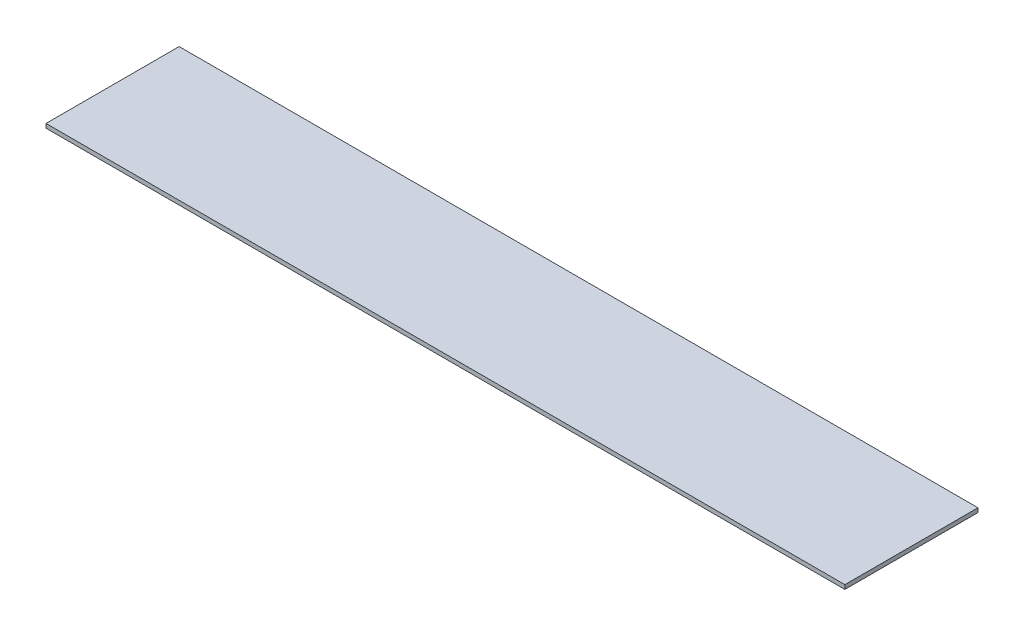
ISO-10303-21;
HEADER;
FILE_DESCRIPTION(('STEP AP214'),'2;1');
FILE_NAME('part.step','',(''),(''),'','','');
FILE_SCHEMA(('AUTOMOTIVE_DESIGN { 1 0 10303 214 1 1 1 1 }'));
ENDSEC;
DATA;
#1=APPLICATION_CONTEXT('core data for automotive mechanical design processes');
#2=APPLICATION_PROTOCOL_DEFINITION('international standard','automotive_design',2000,#1);
#3=PRODUCT_CONTEXT('',#1,'mechanical');
#4=PRODUCT('Part','Part','',(#3));
#5=PRODUCT_RELATED_PRODUCT_CATEGORY('part','',(#4));
#6=PRODUCT_DEFINITION_FORMATION('','',#4);
#7=PRODUCT_DEFINITION_CONTEXT('part definition',#1,'design');
#8=PRODUCT_DEFINITION('design','',#6,#7);
#9=PRODUCT_DEFINITION_SHAPE('','',#8);
#10=(LENGTH_UNIT() NAMED_UNIT(*) SI_UNIT(.MILLI.,.METRE.));
#11=(NAMED_UNIT(*) PLANE_ANGLE_UNIT() SI_UNIT($,.RADIAN.));
#12=(NAMED_UNIT(*) SI_UNIT($,.STERADIAN.) SOLID_ANGLE_UNIT());
#13=UNCERTAINTY_MEASURE_WITH_UNIT(LENGTH_MEASURE(1.E-05),#10,'distance_accuracy_value','');
#14=(GEOMETRIC_REPRESENTATION_CONTEXT(3) GLOBAL_UNCERTAINTY_ASSIGNED_CONTEXT((#13)) GLOBAL_UNIT_ASSIGNED_CONTEXT((#10,
#11,#12)) REPRESENTATION_CONTEXT('',''));
#15=CARTESIAN_POINT('',(0.,0.,0.));
#16=DIRECTION('',(0.,0.,1.));
#17=DIRECTION('',(1.,0.,0.));
#18=AXIS2_PLACEMENT_3D('',#15,#16,#17);
#19=CARTESIAN_POINT('',(0.,-83.437366020411,0.));
#20=DIRECTION('',(1.,0.,0.));
#21=DIRECTION('',(0.,0.,-1.));
#22=AXIS2_PLACEMENT_3D('',#19,#20,#21);
#23=PLANE('',#22);
#24=DIRECTION('',(0.,0.,-1.));
#25=VECTOR('',#24,1.);
#26=CARTESIAN_POINT('',(0.,-80.262366020411,0.));
#27=LINE('',#26,#25);
#28=CARTESIAN_POINT('',(0.,-80.262366020411,101.6));
#29=VERTEX_POINT('',#28);
#30=CARTESIAN_POINT('',(0.,-80.262366020411,0.));
#31=VERTEX_POINT('',#30);
#32=EDGE_CURVE('E98',#29,#31,#27,.T.);
#33=ORIENTED_EDGE('',*,*,#32,.T.);
#34=DIRECTION('',(0.,1.,0.));
#35=VECTOR('',#34,1.);
#36=CARTESIAN_POINT('',(0.,-83.437366020411,0.));
#37=LINE('',#36,#35);
#38=CARTESIAN_POINT('',(0.,-83.437366020411,0.));
#39=VERTEX_POINT('',#38);
#40=EDGE_CURVE('E11',#39,#31,#37,.T.);
#41=ORIENTED_EDGE('',*,*,#40,.F.);
#42=DIRECTION('',(0.,0.,-1.));
#43=VECTOR('',#42,1.);
#44=CARTESIAN_POINT('',(0.,-83.437366020411,0.));
#45=LINE('',#44,#43);
#46=CARTESIAN_POINT('',(0.,-83.437366020411,101.6));
#47=VERTEX_POINT('',#46);
#48=EDGE_CURVE('E86',#47,#39,#45,.T.);
#49=ORIENTED_EDGE('',*,*,#48,.F.);
#50=DIRECTION('',(0.,1.,0.));
#51=VECTOR('',#50,1.);
#52=CARTESIAN_POINT('',(0.,-83.437366020411,101.6));
#53=LINE('',#52,#51);
#54=EDGE_CURVE('E94',#47,#29,#53,.T.);
#55=ORIENTED_EDGE('',*,*,#54,.T.);
#56=EDGE_LOOP('',(#33,#41,#49,#55));
#57=FACE_BOUND('',#56,.T.);
#58=ADVANCED_FACE('F35',(#57),#23,.F.);
#59=CARTESIAN_POINT('',(0.,-83.437366020411,0.));
#60=DIRECTION('',(0.,0.,1.));
#61=DIRECTION('',(1.,0.,0.));
#62=AXIS2_PLACEMENT_3D('',#59,#60,#61);
#63=PLANE('',#62);
#64=DIRECTION('',(1.,0.,0.));
#65=VECTOR('',#64,1.);
#66=CARTESIAN_POINT('',(0.,-80.262366020411,0.));
#67=LINE('',#66,#65);
#68=CARTESIAN_POINT('',(609.6,-80.262366020411,0.));
#69=VERTEX_POINT('',#68);
#70=EDGE_CURVE('E90',#31,#69,#67,.T.);
#71=ORIENTED_EDGE('',*,*,#70,.T.);
#72=DIRECTION('',(0.,1.,0.));
#73=VECTOR('',#72,1.);
#74=CARTESIAN_POINT('',(609.6,-83.437366020411,0.));
#75=LINE('',#74,#73);
#76=CARTESIAN_POINT('',(609.6,-83.437366020411,0.));
#77=VERTEX_POINT('',#76);
#78=EDGE_CURVE('E43',#77,#69,#75,.T.);
#79=ORIENTED_EDGE('',*,*,#78,.F.);
#80=DIRECTION('',(1.,0.,0.));
#81=VECTOR('',#80,1.);
#82=CARTESIAN_POINT('',(0.,-83.437366020411,0.));
#83=LINE('',#82,#81);
#84=EDGE_CURVE('E81',#39,#77,#83,.T.);
#85=ORIENTED_EDGE('',*,*,#84,.F.);
#86=ORIENTED_EDGE('',*,*,#40,.T.);
#87=EDGE_LOOP('',(#71,#79,#85,#86));
#88=FACE_BOUND('',#87,.T.);
#89=ADVANCED_FACE('F89',(#88),#63,.F.);
#90=CARTESIAN_POINT('',(609.6,-83.437366020411,0.));
#91=DIRECTION('',(-1.,0.,0.));
#92=DIRECTION('',(0.,0.,1.));
#93=AXIS2_PLACEMENT_3D('',#90,#91,#92);
#94=PLANE('',#93);
#95=DIRECTION('',(0.,0.,1.));
#96=VECTOR('',#95,1.);
#97=CARTESIAN_POINT('',(609.6,-80.262366020411,0.));
#98=LINE('',#97,#96);
#99=CARTESIAN_POINT('',(609.6,-80.262366020411,101.6));
#100=VERTEX_POINT('',#99);
#101=EDGE_CURVE('E68',#69,#100,#98,.T.);
#102=ORIENTED_EDGE('',*,*,#101,.T.);
#103=DIRECTION('',(0.,1.,0.));
#104=VECTOR('',#103,1.);
#105=CARTESIAN_POINT('',(609.6,-83.437366020411,101.6));
#106=LINE('',#105,#104);
#107=CARTESIAN_POINT('',(609.6,-83.437366020411,101.6));
#108=VERTEX_POINT('',#107);
#109=EDGE_CURVE('E91',#108,#100,#106,.T.);
#110=ORIENTED_EDGE('',*,*,#109,.F.);
#111=DIRECTION('',(0.,0.,1.));
#112=VECTOR('',#111,1.);
#113=CARTESIAN_POINT('',(609.6,-83.437366020411,0.));
#114=LINE('',#113,#112);
#115=EDGE_CURVE('E84',#77,#108,#114,.T.);
#116=ORIENTED_EDGE('',*,*,#115,.F.);
#117=ORIENTED_EDGE('',*,*,#78,.T.);
#118=EDGE_LOOP('',(#102,#110,#116,#117));
#119=FACE_BOUND('',#118,.T.);
#120=ADVANCED_FACE('F92',(#119),#94,.F.);
#121=CARTESIAN_POINT('',(0.,-83.437366020411,101.6));
#122=DIRECTION('',(0.,0.,-1.));
#123=DIRECTION('',(-1.,0.,0.));
#124=AXIS2_PLACEMENT_3D('',#121,#122,#123);
#125=PLANE('',#124);
#126=DIRECTION('',(-1.,0.,0.));
#127=VECTOR('',#126,1.);
#128=CARTESIAN_POINT('',(0.,-80.262366020411,101.6));
#129=LINE('',#128,#127);
#130=EDGE_CURVE('E74',#100,#29,#129,.T.);
#131=ORIENTED_EDGE('',*,*,#130,.T.);
#132=ORIENTED_EDGE('',*,*,#54,.F.);
#133=DIRECTION('',(-1.,0.,0.));
#134=VECTOR('',#133,1.);
#135=CARTESIAN_POINT('',(0.,-83.437366020411,101.6));
#136=LINE('',#135,#134);
#137=EDGE_CURVE('E51',#108,#47,#136,.T.);
#138=ORIENTED_EDGE('',*,*,#137,.F.);
#139=ORIENTED_EDGE('',*,*,#109,.T.);
#140=EDGE_LOOP('',(#131,#132,#138,#139));
#141=FACE_BOUND('',#140,.T.);
#142=ADVANCED_FACE('F105',(#141),#125,.F.);
#143=CARTESIAN_POINT('',(0.,-83.437366020411,0.));
#144=DIRECTION('',(0.,1.,0.));
#145=DIRECTION('',(0.,0.,1.));
#146=AXIS2_PLACEMENT_3D('',#143,#144,#145);
#147=PLANE('',#146);
#148=ORIENTED_EDGE('',*,*,#48,.T.);
#149=ORIENTED_EDGE('',*,*,#84,.T.);
#150=ORIENTED_EDGE('',*,*,#115,.T.);
#151=ORIENTED_EDGE('',*,*,#137,.T.);
#152=EDGE_LOOP('',(#148,#149,#150,#151));
#153=FACE_BOUND('',#152,.T.);
#154=ADVANCED_FACE('F82',(#153),#147,.F.);
#155=CARTESIAN_POINT('',(0.,-80.262366020411,0.));
#156=DIRECTION('',(0.,1.,0.));
#157=DIRECTION('',(0.,0.,1.));
#158=AXIS2_PLACEMENT_3D('',#155,#156,#157);
#159=PLANE('',#158);
#160=ORIENTED_EDGE('',*,*,#32,.F.);
#161=ORIENTED_EDGE('',*,*,#130,.F.);
#162=ORIENTED_EDGE('',*,*,#101,.F.);
#163=ORIENTED_EDGE('',*,*,#70,.F.);
#164=EDGE_LOOP('',(#160,#161,#162,#163));
#165=FACE_BOUND('',#164,.T.);
#166=ADVANCED_FACE('F108',(#165),#159,.T.);
#167=CLOSED_SHELL('',(#58,#89,#120,#142,#154,#166));
#168=MANIFOLD_SOLID_BREP('B2',#167);
#169=ADVANCED_BREP_SHAPE_REPRESENTATION('',(#18,#168),#14);
#170=SHAPE_DEFINITION_REPRESENTATION(#9,#169);
ENDSEC;
END-ISO-10303-21;
